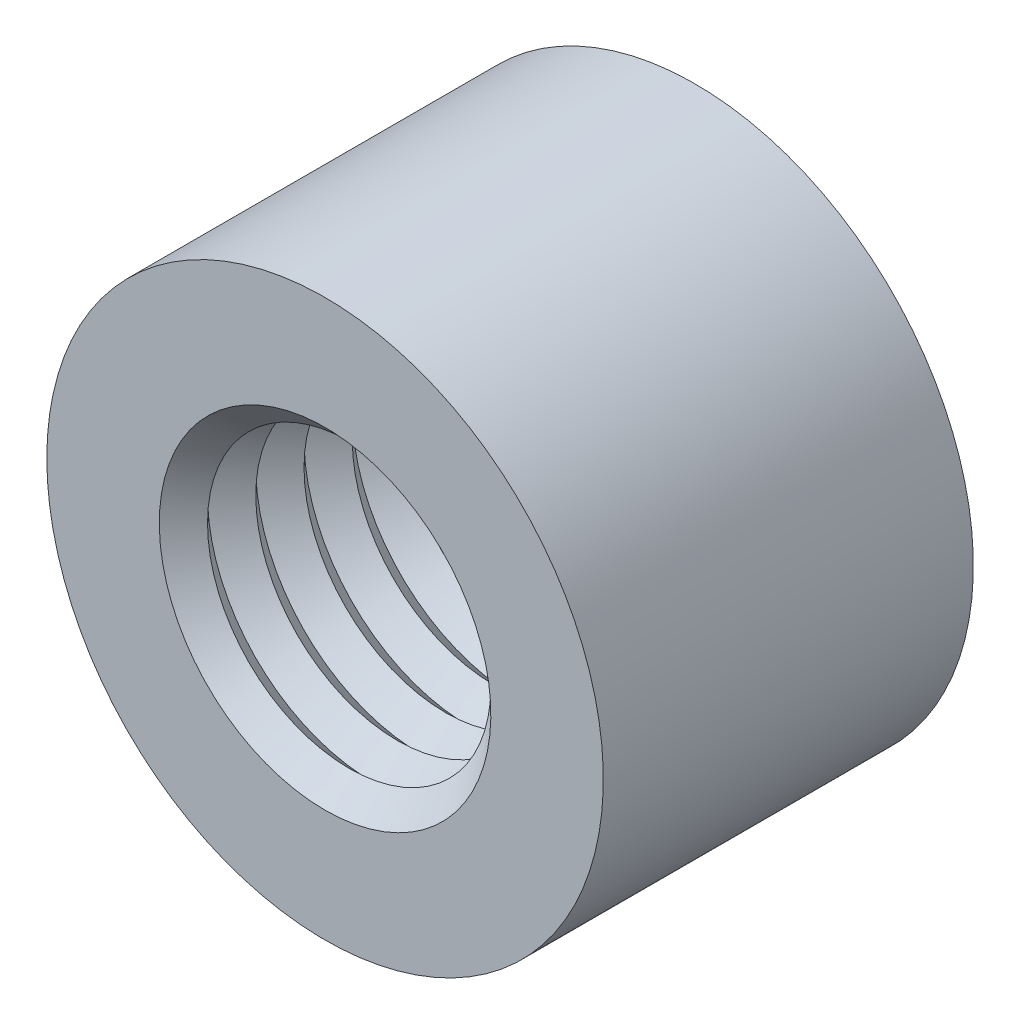
ISO-10303-21;
HEADER;
FILE_DESCRIPTION(('STEP AP214'),'2;1');
FILE_NAME('part.step','',(''),(''),'','','');
FILE_SCHEMA(('AUTOMOTIVE_DESIGN { 1 0 10303 214 1 1 1 1 }'));
ENDSEC;
DATA;
#1=APPLICATION_CONTEXT('core data for automotive mechanical design processes');
#2=APPLICATION_PROTOCOL_DEFINITION('international standard','automotive_design',2000,#1);
#3=PRODUCT_CONTEXT('',#1,'mechanical');
#4=PRODUCT('Part','Part','',(#3));
#5=PRODUCT_RELATED_PRODUCT_CATEGORY('part','',(#4));
#6=PRODUCT_DEFINITION_FORMATION('','',#4);
#7=PRODUCT_DEFINITION_CONTEXT('part definition',#1,'design');
#8=PRODUCT_DEFINITION('design','',#6,#7);
#9=PRODUCT_DEFINITION_SHAPE('','',#8);
#10=(LENGTH_UNIT() NAMED_UNIT(*) SI_UNIT(.MILLI.,.METRE.));
#11=(NAMED_UNIT(*) PLANE_ANGLE_UNIT() SI_UNIT($,.RADIAN.));
#12=(NAMED_UNIT(*) SI_UNIT($,.STERADIAN.) SOLID_ANGLE_UNIT());
#13=UNCERTAINTY_MEASURE_WITH_UNIT(LENGTH_MEASURE(1.E-05),#10,'distance_accuracy_value','');
#14=(GEOMETRIC_REPRESENTATION_CONTEXT(3) GLOBAL_UNCERTAINTY_ASSIGNED_CONTEXT((#13)) GLOBAL_UNIT_ASSIGNED_CONTEXT((#10,
#11,#12)) REPRESENTATION_CONTEXT('',''));
#15=CARTESIAN_POINT('',(0.,0.,0.));
#16=DIRECTION('',(0.,0.,1.));
#17=DIRECTION('',(1.,0.,0.));
#18=AXIS2_PLACEMENT_3D('',#15,#16,#17);
#19=CARTESIAN_POINT('',(0.,0.,1.51915438095784));
#20=DIRECTION('',(0.,0.,-1.));
#21=DIRECTION('',(-1.,0.,0.));
#22=AXIS2_PLACEMENT_3D('',#19,#20,#21);
#23=CONICAL_SURFACE('',#22,1.42239999996718,0.785398163534822);
#24=CARTESIAN_POINT('',(0.,0.,1.72604719040237));
#25=DIRECTION('',(0.,0.,1.));
#26=DIRECTION('',(1.,0.,0.));
#27=AXIS2_PLACEMENT_3D('',#24,#25,#26);
#28=CIRCLE('',#27,1.21550719040897);
#29=CARTESIAN_POINT('',(1.21550719040897,0.,1.72604719040237));
#30=VERTEX_POINT('',#29);
#31=EDGE_CURVE('E29',#30,#30,#28,.T.);
#32=ORIENTED_EDGE('',*,*,#31,.T.);
#33=EDGE_LOOP('',(#32));
#34=FACE_BOUND('',#33,.T.);
#35=CARTESIAN_POINT('',(0.,0.,1.51903719046233));
#36=DIRECTION('',(0.,0.,-1.));
#37=DIRECTION('',(-1.,0.,0.));
#38=AXIS2_PLACEMENT_3D('',#35,#36,#37);
#39=CIRCLE('',#38,1.42251719046273);
#40=CARTESIAN_POINT('',(-1.42251719046273,0.,1.51903719046233));
#41=VERTEX_POINT('',#40);
#42=EDGE_CURVE('E17',#41,#41,#39,.T.);
#43=ORIENTED_EDGE('',*,*,#42,.T.);
#44=EDGE_LOOP('',(#43));
#45=FACE_BOUND('',#44,.T.);
#46=ADVANCED_FACE('F14',(#34,#45),#23,.F.);
#47=CARTESIAN_POINT('',(0.,0.,1.93293999996058));
#48=DIRECTION('',(0.,0.,1.));
#49=DIRECTION('',(1.,0.,0.));
#50=AXIS2_PLACEMENT_3D('',#47,#48,#49);
#51=CONICAL_SURFACE('',#50,1.42239999996718,0.785398163397448);
#52=CARTESIAN_POINT('',(0.,0.,1.93305719042771));
#53=DIRECTION('',(0.,0.,1.));
#54=DIRECTION('',(1.,0.,0.));
#55=AXIS2_PLACEMENT_3D('',#52,#53,#54);
#56=CIRCLE('',#55,1.42251719043431);
#57=CARTESIAN_POINT('',(1.42251719043431,0.,1.93305719042771));
#58=VERTEX_POINT('',#57);
#59=EDGE_CURVE('E53',#58,#58,#56,.T.);
#60=ORIENTED_EDGE('',*,*,#59,.T.);
#61=EDGE_LOOP('',(#60));
#62=FACE_BOUND('',#61,.T.);
#63=ORIENTED_EDGE('',*,*,#31,.F.);
#64=EDGE_LOOP('',(#63));
#65=FACE_BOUND('',#64,.T.);
#66=ADVANCED_FACE('F66',(#62,#65),#51,.F.);
#67=CARTESIAN_POINT('',(0.,0.,1.51892000002363));
#68=DIRECTION('',(0.,0.,1.));
#69=DIRECTION('',(1.,0.,0.));
#70=AXIS2_PLACEMENT_3D('',#67,#68,#69);
#71=CONICAL_SURFACE('',#70,1.42240000002403,0.785398163397448);
#72=CARTESIAN_POINT('',(0.,0.,1.31202719046541));
#73=DIRECTION('',(0.,0.,-1.));
#74=DIRECTION('',(-1.,0.,0.));
#75=AXIS2_PLACEMENT_3D('',#72,#73,#74);
#76=CIRCLE('',#75,1.21550719035213);
#77=CARTESIAN_POINT('',(-1.21550719035213,0.,1.31202719046541));
#78=VERTEX_POINT('',#77);
#79=EDGE_CURVE('E55',#78,#78,#76,.T.);
#80=ORIENTED_EDGE('',*,*,#79,.T.);
#81=EDGE_LOOP('',(#80));
#82=FACE_BOUND('',#81,.T.);
#83=ORIENTED_EDGE('',*,*,#42,.F.);
#84=EDGE_LOOP('',(#83));
#85=FACE_BOUND('',#84,.T.);
#86=ADVANCED_FACE('F68',(#82,#85),#71,.F.);
#87=CARTESIAN_POINT('',(0.,0.,1.9331743808948));
#88=DIRECTION('',(0.,0.,-1.));
#89=DIRECTION('',(-1.,0.,0.));
#90=AXIS2_PLACEMENT_3D('',#87,#88,#89);
#91=CONICAL_SURFACE('',#90,1.42239999996718,0.785398163534822);
#92=ORIENTED_EDGE('',*,*,#59,.F.);
#93=EDGE_LOOP('',(#92));
#94=FACE_BOUND('',#93,.T.);
#95=CARTESIAN_POINT('',(0.,0.,2.14006719033932));
#96=DIRECTION('',(0.,0.,1.));
#97=DIRECTION('',(1.,0.,0.));
#98=AXIS2_PLACEMENT_3D('',#95,#96,#97);
#99=CIRCLE('',#98,1.21550719040897);
#100=CARTESIAN_POINT('',(1.21550719040897,0.,2.14006719033932));
#101=VERTEX_POINT('',#100);
#102=EDGE_CURVE('E52',#101,#101,#99,.T.);
#103=ORIENTED_EDGE('',*,*,#102,.T.);
#104=EDGE_LOOP('',(#103));
#105=FACE_BOUND('',#104,.T.);
#106=ADVANCED_FACE('F74',(#94,#105),#91,.F.);
#107=CARTESIAN_POINT('',(0.,0.,1.1051343809072));
#108=DIRECTION('',(0.,0.,-1.));
#109=DIRECTION('',(-1.,0.,0.));
#110=AXIS2_PLACEMENT_3D('',#107,#108,#109);
#111=CONICAL_SURFACE('',#110,1.42239999996718,0.785398163534822);
#112=ORIENTED_EDGE('',*,*,#79,.F.);
#113=EDGE_LOOP('',(#112));
#114=FACE_BOUND('',#113,.T.);
#115=CARTESIAN_POINT('',(0.,0.,1.10501719044011));
#116=DIRECTION('',(0.,0.,-1.));
#117=DIRECTION('',(-1.,0.,0.));
#118=AXIS2_PLACEMENT_3D('',#115,#116,#117);
#119=CIRCLE('',#118,1.42251719043431);
#120=CARTESIAN_POINT('',(-1.42251719043431,0.,1.10501719044011));
#121=VERTEX_POINT('',#120);
#122=EDGE_CURVE('E50',#121,#121,#119,.T.);
#123=ORIENTED_EDGE('',*,*,#122,.T.);
#124=EDGE_LOOP('',(#123));
#125=FACE_BOUND('',#124,.T.);
#126=ADVANCED_FACE('F131',(#114,#125),#111,.F.);
#127=CARTESIAN_POINT('',(0.,0.,2.34696000006807));
#128=DIRECTION('',(0.,0.,1.));
#129=DIRECTION('',(1.,0.,0.));
#130=AXIS2_PLACEMENT_3D('',#127,#128,#129);
#131=CONICAL_SURFACE('',#130,1.42240000013771,0.785398163397448);
#132=CARTESIAN_POINT('',(0.,0.,2.34707719039308));
#133=DIRECTION('',(0.,0.,1.));
#134=DIRECTION('',(1.,0.,0.));
#135=AXIS2_PLACEMENT_3D('',#132,#133,#134);
#136=CIRCLE('',#135,1.42251719046273);
#137=CARTESIAN_POINT('',(1.42251719046273,0.,2.34707719039308));
#138=VERTEX_POINT('',#137);
#139=EDGE_CURVE('E46',#138,#138,#136,.T.);
#140=ORIENTED_EDGE('',*,*,#139,.T.);
#141=EDGE_LOOP('',(#140));
#142=FACE_BOUND('',#141,.T.);
#143=ORIENTED_EDGE('',*,*,#102,.F.);
#144=EDGE_LOOP('',(#143));
#145=FACE_BOUND('',#144,.T.);
#146=ADVANCED_FACE('F127',(#142,#145),#131,.F.);
#147=CARTESIAN_POINT('',(0.,0.,1.10490000002983));
#148=DIRECTION('',(0.,0.,1.));
#149=DIRECTION('',(1.,0.,0.));
#150=AXIS2_PLACEMENT_3D('',#147,#148,#149);
#151=CONICAL_SURFACE('',#150,1.42240000002403,0.785398163397448);
#152=CARTESIAN_POINT('',(0.,0.,0.898007190471617));
#153=DIRECTION('',(0.,0.,-1.));
#154=DIRECTION('',(-1.,0.,0.));
#155=AXIS2_PLACEMENT_3D('',#152,#153,#154);
#156=CIRCLE('',#155,1.21550719035213);
#157=CARTESIAN_POINT('',(-1.21550719035213,0.,0.898007190471617));
#158=VERTEX_POINT('',#157);
#159=EDGE_CURVE('E49',#158,#158,#156,.T.);
#160=ORIENTED_EDGE('',*,*,#159,.T.);
#161=EDGE_LOOP('',(#160));
#162=FACE_BOUND('',#161,.T.);
#163=ORIENTED_EDGE('',*,*,#122,.F.);
#164=EDGE_LOOP('',(#163));
#165=FACE_BOUND('',#164,.T.);
#166=ADVANCED_FACE('F123',(#162,#165),#151,.F.);
#167=CARTESIAN_POINT('',(0.,0.,2.3471943808886));
#168=DIRECTION('',(0.,0.,-1.));
#169=DIRECTION('',(-1.,0.,0.));
#170=AXIS2_PLACEMENT_3D('',#167,#168,#169);
#171=CONICAL_SURFACE('',#170,1.42239999996718,0.785398163534822);
#172=ORIENTED_EDGE('',*,*,#139,.F.);
#173=EDGE_LOOP('',(#172));
#174=FACE_BOUND('',#173,.T.);
#175=CARTESIAN_POINT('',(0.,0.,2.55408719033312));
#176=DIRECTION('',(0.,0.,1.));
#177=DIRECTION('',(1.,0.,0.));
#178=AXIS2_PLACEMENT_3D('',#175,#176,#177);
#179=CIRCLE('',#178,1.21550719040897);
#180=CARTESIAN_POINT('',(1.21550719040897,0.,2.55408719033312));
#181=VERTEX_POINT('',#180);
#182=EDGE_CURVE('E45',#181,#181,#179,.T.);
#183=ORIENTED_EDGE('',*,*,#182,.T.);
#184=EDGE_LOOP('',(#183));
#185=FACE_BOUND('',#184,.T.);
#186=ADVANCED_FACE('F119',(#174,#185),#171,.F.);
#187=CARTESIAN_POINT('',(0.,0.,0.691114380913405));
#188=DIRECTION('',(0.,0.,-1.));
#189=DIRECTION('',(-1.,0.,0.));
#190=AXIS2_PLACEMENT_3D('',#187,#188,#189);
#191=CONICAL_SURFACE('',#190,1.42239999996718,0.785398163534822);
#192=ORIENTED_EDGE('',*,*,#159,.F.);
#193=EDGE_LOOP('',(#192));
#194=FACE_BOUND('',#193,.T.);
#195=CARTESIAN_POINT('',(0.,0.,0.690997190417875));
#196=DIRECTION('',(0.,0.,-1.));
#197=DIRECTION('',(-1.,0.,0.));
#198=AXIS2_PLACEMENT_3D('',#195,#196,#197);
#199=CIRCLE('',#198,1.42251719046275);
#200=CARTESIAN_POINT('',(-1.42251719046275,0.,0.690997190417875));
#201=VERTEX_POINT('',#200);
#202=EDGE_CURVE('E42',#201,#201,#199,.T.);
#203=ORIENTED_EDGE('',*,*,#202,.T.);
#204=EDGE_LOOP('',(#203));
#205=FACE_BOUND('',#204,.T.);
#206=ADVANCED_FACE('F115',(#194,#205),#191,.F.);
#207=CARTESIAN_POINT('',(0.,0.,2.76097999994818));
#208=DIRECTION('',(0.,0.,1.));
#209=DIRECTION('',(1.,0.,0.));
#210=AXIS2_PLACEMENT_3D('',#207,#208,#209);
#211=CONICAL_SURFACE('',#210,1.42239999996718,0.785398163260074);
#212=CARTESIAN_POINT('',(0.,0.,2.76109719038688));
#213=DIRECTION('',(0.,0.,1.));
#214=DIRECTION('',(1.,0.,0.));
#215=AXIS2_PLACEMENT_3D('',#212,#213,#214);
#216=CIRCLE('',#215,1.42251719040585);
#217=CARTESIAN_POINT('',(1.42251719040585,0.,2.76109719038688));
#218=VERTEX_POINT('',#217);
#219=EDGE_CURVE('E38',#218,#218,#216,.T.);
#220=ORIENTED_EDGE('',*,*,#219,.T.);
#221=EDGE_LOOP('',(#220));
#222=FACE_BOUND('',#221,.T.);
#223=ORIENTED_EDGE('',*,*,#182,.F.);
#224=EDGE_LOOP('',(#223));
#225=FACE_BOUND('',#224,.T.);
#226=ADVANCED_FACE('F111',(#222,#225),#211,.F.);
#227=CARTESIAN_POINT('',(0.,0.,0.690879999979188));
#228=DIRECTION('',(0.,0.,1.));
#229=DIRECTION('',(1.,0.,0.));
#230=AXIS2_PLACEMENT_3D('',#227,#228,#229);
#231=CONICAL_SURFACE('',#230,1.42240000002403,0.785398163534822);
#232=CARTESIAN_POINT('',(0.,0.,0.483987190477819));
#233=DIRECTION('',(0.,0.,-1.));
#234=DIRECTION('',(-1.,0.,0.));
#235=AXIS2_PLACEMENT_3D('',#232,#233,#234);
#236=CIRCLE('',#235,1.21550719035213);
#237=CARTESIAN_POINT('',(-1.21550719035213,0.,0.483987190477819));
#238=VERTEX_POINT('',#237);
#239=EDGE_CURVE('E41',#238,#238,#236,.T.);
#240=ORIENTED_EDGE('',*,*,#239,.T.);
#241=EDGE_LOOP('',(#240));
#242=FACE_BOUND('',#241,.T.);
#243=ORIENTED_EDGE('',*,*,#202,.F.);
#244=EDGE_LOOP('',(#243));
#245=FACE_BOUND('',#244,.T.);
#246=ADVANCED_FACE('F107',(#242,#245),#231,.F.);
#247=CARTESIAN_POINT('',(0.,0.,2.76121438082555));
#248=DIRECTION('',(0.,0.,-1.));
#249=DIRECTION('',(-1.,0.,0.));
#250=AXIS2_PLACEMENT_3D('',#247,#248,#249);
#251=CONICAL_SURFACE('',#250,1.42239999996718,0.785398163397448);
#252=ORIENTED_EDGE('',*,*,#219,.F.);
#253=EDGE_LOOP('',(#252));
#254=FACE_BOUND('',#253,.T.);
#255=CARTESIAN_POINT('',(0.,0.,2.96810719044061));
#256=DIRECTION('',(0.,0.,1.));
#257=DIRECTION('',(1.,0.,0.));
#258=AXIS2_PLACEMENT_3D('',#255,#256,#257);
#259=CIRCLE('',#258,1.21550719040897);
#260=CARTESIAN_POINT('',(1.21550719040897,0.,2.96810719044061));
#261=VERTEX_POINT('',#260);
#262=EDGE_CURVE('E152',#261,#261,#259,.T.);
#263=ORIENTED_EDGE('',*,*,#262,.T.);
#264=EDGE_LOOP('',(#263));
#265=FACE_BOUND('',#264,.T.);
#266=ADVANCED_FACE('F103',(#254,#265),#251,.F.);
#267=CARTESIAN_POINT('',(0.,0.,0.277094380919607));
#268=DIRECTION('',(0.,0.,-1.));
#269=DIRECTION('',(-1.,0.,0.));
#270=AXIS2_PLACEMENT_3D('',#267,#268,#269);
#271=CONICAL_SURFACE('',#270,1.42239999996718,0.785398163534822);
#272=ORIENTED_EDGE('',*,*,#239,.F.);
#273=EDGE_LOOP('',(#272));
#274=FACE_BOUND('',#273,.T.);
#275=CARTESIAN_POINT('',(0.,0.,0.277094380779086));
#276=DIRECTION('',(0.,0.,1.));
#277=DIRECTION('',(1.,0.,0.));
#278=AXIS2_PLACEMENT_3D('',#275,#276,#277);
#279=CIRCLE('',#278,1.4224);
#280=CARTESIAN_POINT('',(1.4224,0.,0.277094380779086));
#281=VERTEX_POINT('',#280);
#282=EDGE_CURVE('E37',#281,#281,#279,.F.);
#283=ORIENTED_EDGE('',*,*,#282,.T.);
#284=EDGE_LOOP('',(#283));
#285=FACE_BOUND('',#284,.T.);
#286=ADVANCED_FACE('F99',(#274,#285),#271,.F.);
#287=CARTESIAN_POINT('',(0.,0.,3.1750000001125));
#288=DIRECTION('',(0.,0.,1.));
#289=DIRECTION('',(0.,-1.,0.));
#290=AXIS2_PLACEMENT_3D('',#287,#288,#289);
#291=CONICAL_SURFACE('',#290,1.42240000008087,0.785398163397448);
#292=CARTESIAN_POINT('',(0.,0.,3.17499999999882));
#293=DIRECTION('',(0.,0.,1.));
#294=DIRECTION('',(0.,-1.,0.));
#295=AXIS2_PLACEMENT_3D('',#292,#293,#294);
#296=CIRCLE('',#295,1.42239999996718);
#297=CARTESIAN_POINT('',(0.,-1.42239999996718,3.17499999999882));
#298=VERTEX_POINT('',#297);
#299=EDGE_CURVE('E34',#298,#298,#296,.F.);
#300=ORIENTED_EDGE('',*,*,#299,.F.);
#301=EDGE_LOOP('',(#300));
#302=FACE_BOUND('',#301,.T.);
#303=ORIENTED_EDGE('',*,*,#262,.F.);
#304=EDGE_LOOP('',(#303));
#305=FACE_BOUND('',#304,.T.);
#306=ADVANCED_FACE('F95',(#302,#305),#291,.F.);
#307=CARTESIAN_POINT('',(0.,0.,0.));
#308=DIRECTION('',(0.,0.,1.));
#309=DIRECTION('',(1.,0.,0.));
#310=AXIS2_PLACEMENT_3D('',#307,#308,#309);
#311=CYLINDRICAL_SURFACE('',#310,1.4224);
#312=CARTESIAN_POINT('',(0.,0.,0.));
#313=DIRECTION('',(0.,0.,1.));
#314=DIRECTION('',(1.,0.,0.));
#315=AXIS2_PLACEMENT_3D('',#312,#313,#314);
#316=CIRCLE('',#315,1.4224);
#317=CARTESIAN_POINT('',(1.4224,0.,0.));
#318=VERTEX_POINT('',#317);
#319=EDGE_CURVE('E26',#318,#318,#316,.F.);
#320=ORIENTED_EDGE('',*,*,#319,.T.);
#321=EDGE_LOOP('',(#320));
#322=FACE_BOUND('',#321,.T.);
#323=ORIENTED_EDGE('',*,*,#282,.F.);
#324=EDGE_LOOP('',(#323));
#325=FACE_BOUND('',#324,.T.);
#326=ADVANCED_FACE('F91',(#322,#325),#311,.F.);
#327=CARTESIAN_POINT('',(0.,0.,3.175));
#328=DIRECTION('',(0.,0.,1.));
#329=DIRECTION('',(1.,0.,0.));
#330=AXIS2_PLACEMENT_3D('',#327,#328,#329);
#331=PLANE('',#330);
#332=CARTESIAN_POINT('',(0.,0.,3.175));
#333=DIRECTION('',(0.,0.,-1.));
#334=DIRECTION('',(-1.,0.,0.));
#335=AXIS2_PLACEMENT_3D('',#332,#333,#334);
#336=CIRCLE('',#335,2.3876);
#337=CARTESIAN_POINT('',(-2.3876,0.,3.175));
#338=VERTEX_POINT('',#337);
#339=EDGE_CURVE('E21',#338,#338,#336,.T.);
#340=ORIENTED_EDGE('',*,*,#339,.F.);
#341=EDGE_LOOP('',(#340));
#342=FACE_BOUND('',#341,.T.);
#343=ORIENTED_EDGE('',*,*,#299,.T.);
#344=EDGE_LOOP('',(#343));
#345=FACE_BOUND('',#344,.T.);
#346=ADVANCED_FACE('F84',(#342,#345),#331,.T.);
#347=CARTESIAN_POINT('',(0.,0.,0.));
#348=DIRECTION('',(0.,0.,1.));
#349=DIRECTION('',(1.,0.,0.));
#350=AXIS2_PLACEMENT_3D('',#347,#348,#349);
#351=PLANE('',#350);
#352=CARTESIAN_POINT('',(0.,0.,0.));
#353=DIRECTION('',(0.,0.,-1.));
#354=DIRECTION('',(-1.,0.,0.));
#355=AXIS2_PLACEMENT_3D('',#352,#353,#354);
#356=CIRCLE('',#355,2.3876);
#357=CARTESIAN_POINT('',(-2.3876,0.,0.));
#358=VERTEX_POINT('',#357);
#359=EDGE_CURVE('E10',#358,#358,#356,.F.);
#360=ORIENTED_EDGE('',*,*,#359,.F.);
#361=EDGE_LOOP('',(#360));
#362=FACE_BOUND('',#361,.T.);
#363=ORIENTED_EDGE('',*,*,#319,.F.);
#364=EDGE_LOOP('',(#363));
#365=FACE_BOUND('',#364,.T.);
#366=ADVANCED_FACE('F79',(#362,#365),#351,.F.);
#367=CARTESIAN_POINT('',(0.,0.,3.175));
#368=DIRECTION('',(0.,0.,-1.));
#369=DIRECTION('',(-1.,0.,0.));
#370=AXIS2_PLACEMENT_3D('',#367,#368,#369);
#371=CYLINDRICAL_SURFACE('',#370,2.3876);
#372=ORIENTED_EDGE('',*,*,#359,.T.);
#373=EDGE_LOOP('',(#372));
#374=FACE_BOUND('',#373,.T.);
#375=ORIENTED_EDGE('',*,*,#339,.T.);
#376=EDGE_LOOP('',(#375));
#377=FACE_BOUND('',#376,.T.);
#378=ADVANCED_FACE('F77',(#374,#377),#371,.T.);
#379=CLOSED_SHELL('',(#46,#66,#86,#106,#126,#146,#166,#186,#206,#226,#246,#266,#286,#306,#326,
#346,#366,#378));
#380=MANIFOLD_SOLID_BREP('B1',#379);
#381=ADVANCED_BREP_SHAPE_REPRESENTATION('',(#18,#380),#14);
#382=SHAPE_DEFINITION_REPRESENTATION(#9,#381);
ENDSEC;
END-ISO-10303-21;
